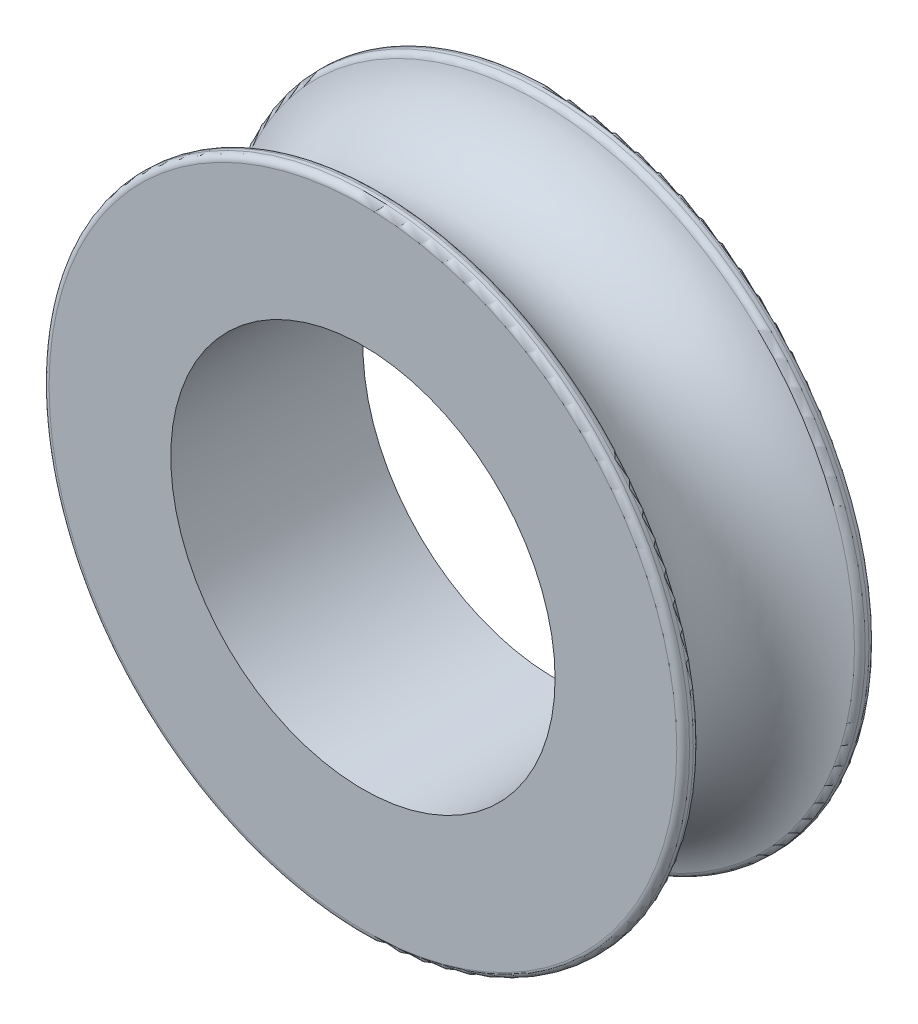
ISO-10303-21;
HEADER;
FILE_DESCRIPTION(('STEP AP214'),'2;1');
FILE_NAME('part.step','',(''),(''),'','','');
FILE_SCHEMA(('AUTOMOTIVE_DESIGN { 1 0 10303 214 1 1 1 1 }'));
ENDSEC;
DATA;
#1=APPLICATION_CONTEXT('core data for automotive mechanical design processes');
#2=APPLICATION_PROTOCOL_DEFINITION('international standard','automotive_design',2000,#1);
#3=PRODUCT_CONTEXT('',#1,'mechanical');
#4=PRODUCT('Part','Part','',(#3));
#5=PRODUCT_RELATED_PRODUCT_CATEGORY('part','',(#4));
#6=PRODUCT_DEFINITION_FORMATION('','',#4);
#7=PRODUCT_DEFINITION_CONTEXT('part definition',#1,'design');
#8=PRODUCT_DEFINITION('design','',#6,#7);
#9=PRODUCT_DEFINITION_SHAPE('','',#8);
#10=(LENGTH_UNIT() NAMED_UNIT(*) SI_UNIT(.MILLI.,.METRE.));
#11=(NAMED_UNIT(*) PLANE_ANGLE_UNIT() SI_UNIT($,.RADIAN.));
#12=(NAMED_UNIT(*) SI_UNIT($,.STERADIAN.) SOLID_ANGLE_UNIT());
#13=UNCERTAINTY_MEASURE_WITH_UNIT(LENGTH_MEASURE(1.E-05),#10,'distance_accuracy_value','');
#14=(GEOMETRIC_REPRESENTATION_CONTEXT(3) GLOBAL_UNCERTAINTY_ASSIGNED_CONTEXT((#13)) GLOBAL_UNIT_ASSIGNED_CONTEXT((#10,
#11,#12)) REPRESENTATION_CONTEXT('',''));
#15=CARTESIAN_POINT('',(0.,0.,0.));
#16=DIRECTION('',(0.,0.,1.));
#17=DIRECTION('',(1.,0.,0.));
#18=AXIS2_PLACEMENT_3D('',#15,#16,#17);
#19=CARTESIAN_POINT('',(0.,0.,0.));
#20=DIRECTION('',(0.,0.,1.));
#21=DIRECTION('',(1.,0.,0.));
#22=AXIS2_PLACEMENT_3D('',#19,#20,#21);
#23=CYLINDRICAL_SURFACE('',#22,3.);
#24=CARTESIAN_POINT('',(0.,0.,-1.5));
#25=DIRECTION('',(0.,0.,1.));
#26=DIRECTION('',(1.,0.,0.));
#27=AXIS2_PLACEMENT_3D('',#24,#25,#26);
#28=CIRCLE('',#27,3.);
#29=CARTESIAN_POINT('',(3.,0.,-1.5));
#30=VERTEX_POINT('',#29);
#31=EDGE_CURVE('E66',#30,#30,#28,.T.);
#32=ORIENTED_EDGE('',*,*,#31,.F.);
#33=EDGE_LOOP('',(#32));
#34=FACE_BOUND('',#33,.T.);
#35=CARTESIAN_POINT('',(0.,0.,1.5));
#36=DIRECTION('',(0.,0.,1.));
#37=DIRECTION('',(1.,0.,0.));
#38=AXIS2_PLACEMENT_3D('',#35,#36,#37);
#39=CIRCLE('',#38,3.);
#40=CARTESIAN_POINT('',(3.,0.,1.5));
#41=VERTEX_POINT('',#40);
#42=EDGE_CURVE('E63',#41,#41,#39,.T.);
#43=ORIENTED_EDGE('',*,*,#42,.T.);
#44=EDGE_LOOP('',(#43));
#45=FACE_BOUND('',#44,.T.);
#46=ADVANCED_FACE('F31',(#34,#45),#23,.F.);
#47=CARTESIAN_POINT('',(0.,3.,1.5));
#48=DIRECTION('',(0.,0.,1.));
#49=DIRECTION('',(1.,0.,0.));
#50=AXIS2_PLACEMENT_3D('',#47,#48,#49);
#51=PLANE('',#50);
#52=CARTESIAN_POINT('',(0.,0.,1.5));
#53=DIRECTION('',(0.,0.,1.));
#54=DIRECTION('',(1.,0.,0.));
#55=AXIS2_PLACEMENT_3D('',#52,#53,#54);
#56=CIRCLE('',#55,4.9);
#57=CARTESIAN_POINT('',(4.9,0.,1.5));
#58=VERTEX_POINT('',#57);
#59=EDGE_CURVE('E60',#58,#58,#56,.T.);
#60=ORIENTED_EDGE('',*,*,#59,.T.);
#61=EDGE_LOOP('',(#60));
#62=FACE_BOUND('',#61,.T.);
#63=ORIENTED_EDGE('',*,*,#42,.F.);
#64=EDGE_LOOP('',(#63));
#65=FACE_BOUND('',#64,.T.);
#66=ADVANCED_FACE('F74',(#62,#65),#51,.T.);
#67=CARTESIAN_POINT('',(0.,0.,0.));
#68=DIRECTION('',(0.,0.,1.));
#69=DIRECTION('',(1.,0.,0.));
#70=AXIS2_PLACEMENT_3D('',#67,#68,#69);
#71=CYLINDRICAL_SURFACE('',#70,5.);
#72=CARTESIAN_POINT('',(0.,0.,1.4));
#73=DIRECTION('',(0.,0.,1.));
#74=DIRECTION('',(1.,0.,0.));
#75=AXIS2_PLACEMENT_3D('',#72,#73,#74);
#76=CIRCLE('',#75,5.);
#77=CARTESIAN_POINT('',(5.,0.,1.4));
#78=VERTEX_POINT('',#77);
#79=EDGE_CURVE('E54',#78,#78,#76,.F.);
#80=ORIENTED_EDGE('',*,*,#79,.T.);
#81=EDGE_LOOP('',(#80));
#82=FACE_BOUND('',#81,.T.);
#83=CARTESIAN_POINT('',(0.,0.,1.34164078649987));
#84=DIRECTION('',(0.,0.,-1.));
#85=DIRECTION('',(-1.,0.,0.));
#86=AXIS2_PLACEMENT_3D('',#83,#84,#85);
#87=CIRCLE('',#86,5.);
#88=CARTESIAN_POINT('',(-5.,0.,1.34164078649987));
#89=VERTEX_POINT('',#88);
#90=EDGE_CURVE('E57',#89,#89,#87,.F.);
#91=ORIENTED_EDGE('',*,*,#90,.T.);
#92=EDGE_LOOP('',(#91));
#93=FACE_BOUND('',#92,.T.);
#94=ADVANCED_FACE('F79',(#82,#93),#71,.T.);
#95=CARTESIAN_POINT('',(0.,0.,0.));
#96=DIRECTION('',(0.,0.,1.));
#97=DIRECTION('',(1.,0.,0.));
#98=AXIS2_PLACEMENT_3D('',#95,#96,#97);
#99=TOROIDAL_SURFACE('',#98,5.3,1.3);
#100=CARTESIAN_POINT('',(0.,0.,1.24580930174994));
#101=DIRECTION('',(0.,0.,-1.));
#102=DIRECTION('',(-1.,0.,0.));
#103=AXIS2_PLACEMENT_3D('',#100,#101,#102);
#104=CIRCLE('',#103,4.92857142857141);
#105=CARTESIAN_POINT('',(-4.92857142857141,0.,1.24580930174994));
#106=VERTEX_POINT('',#105);
#107=EDGE_CURVE('E46',#106,#106,#104,.T.);
#108=ORIENTED_EDGE('',*,*,#107,.T.);
#109=EDGE_LOOP('',(#108));
#110=FACE_BOUND('',#109,.T.);
#111=CARTESIAN_POINT('',(0.,0.,-1.24580930174988));
#112=DIRECTION('',(0.,0.,1.));
#113=DIRECTION('',(1.,0.,0.));
#114=AXIS2_PLACEMENT_3D('',#111,#112,#113);
#115=CIRCLE('',#114,4.92857142857143);
#116=CARTESIAN_POINT('',(4.92857142857143,0.,-1.24580930174988));
#117=VERTEX_POINT('',#116);
#118=EDGE_CURVE('E51',#117,#117,#115,.T.);
#119=ORIENTED_EDGE('',*,*,#118,.T.);
#120=EDGE_LOOP('',(#119));
#121=FACE_BOUND('',#120,.T.);
#122=ADVANCED_FACE('F85',(#110,#121),#99,.F.);
#123=CARTESIAN_POINT('',(0.,0.,0.));
#124=DIRECTION('',(0.,0.,1.));
#125=DIRECTION('',(1.,0.,0.));
#126=AXIS2_PLACEMENT_3D('',#123,#124,#125);
#127=CYLINDRICAL_SURFACE('',#126,5.);
#128=CARTESIAN_POINT('',(0.,0.,-1.34164078649987));
#129=DIRECTION('',(0.,0.,-1.));
#130=DIRECTION('',(-1.,0.,0.));
#131=AXIS2_PLACEMENT_3D('',#128,#129,#130);
#132=CIRCLE('',#131,5.);
#133=CARTESIAN_POINT('',(-5.,0.,-1.34164078649987));
#134=VERTEX_POINT('',#133);
#135=EDGE_CURVE('E38',#134,#134,#132,.T.);
#136=ORIENTED_EDGE('',*,*,#135,.T.);
#137=EDGE_LOOP('',(#136));
#138=FACE_BOUND('',#137,.T.);
#139=CARTESIAN_POINT('',(0.,0.,-1.4));
#140=DIRECTION('',(0.,0.,1.));
#141=DIRECTION('',(1.,0.,0.));
#142=AXIS2_PLACEMENT_3D('',#139,#140,#141);
#143=CIRCLE('',#142,5.);
#144=CARTESIAN_POINT('',(5.,0.,-1.4));
#145=VERTEX_POINT('',#144);
#146=EDGE_CURVE('E42',#145,#145,#143,.T.);
#147=ORIENTED_EDGE('',*,*,#146,.T.);
#148=EDGE_LOOP('',(#147));
#149=FACE_BOUND('',#148,.T.);
#150=ADVANCED_FACE('F108',(#138,#149),#127,.T.);
#151=CARTESIAN_POINT('',(0.,3.,-1.5));
#152=DIRECTION('',(0.,0.,1.));
#153=DIRECTION('',(1.,0.,0.));
#154=AXIS2_PLACEMENT_3D('',#151,#152,#153);
#155=PLANE('',#154);
#156=CARTESIAN_POINT('',(0.,0.,-1.5));
#157=DIRECTION('',(0.,0.,1.));
#158=DIRECTION('',(1.,0.,0.));
#159=AXIS2_PLACEMENT_3D('',#156,#157,#158);
#160=CIRCLE('',#159,4.9);
#161=CARTESIAN_POINT('',(4.9,0.,-1.5));
#162=VERTEX_POINT('',#161);
#163=EDGE_CURVE('E10',#162,#162,#160,.F.);
#164=ORIENTED_EDGE('',*,*,#163,.T.);
#165=EDGE_LOOP('',(#164));
#166=FACE_BOUND('',#165,.T.);
#167=ORIENTED_EDGE('',*,*,#31,.T.);
#168=EDGE_LOOP('',(#167));
#169=FACE_BOUND('',#168,.T.);
#170=ADVANCED_FACE('F70',(#166,#169),#155,.F.);
#171=CARTESIAN_POINT('',(0.,0.,1.4));
#172=DIRECTION('',(0.,0.,1.));
#173=DIRECTION('',(1.,0.,0.));
#174=AXIS2_PLACEMENT_3D('',#171,#172,#173);
#175=TOROIDAL_SURFACE('',#174,4.9,0.1);
#176=ORIENTED_EDGE('',*,*,#79,.F.);
#177=EDGE_LOOP('',(#176));
#178=FACE_BOUND('',#177,.T.);
#179=ORIENTED_EDGE('',*,*,#59,.F.);
#180=EDGE_LOOP('',(#179));
#181=FACE_BOUND('',#180,.T.);
#182=ADVANCED_FACE('F90',(#178,#181),#175,.T.);
#183=CARTESIAN_POINT('',(0.,0.,1.34164078649987));
#184=DIRECTION('',(0.,0.,-1.));
#185=DIRECTION('',(-1.,0.,0.));
#186=AXIS2_PLACEMENT_3D('',#183,#184,#185);
#187=TOROIDAL_SURFACE('',#186,4.9,0.1);
#188=ORIENTED_EDGE('',*,*,#107,.F.);
#189=EDGE_LOOP('',(#188));
#190=FACE_BOUND('',#189,.T.);
#191=ORIENTED_EDGE('',*,*,#90,.F.);
#192=EDGE_LOOP('',(#191));
#193=FACE_BOUND('',#192,.T.);
#194=ADVANCED_FACE('F93',(#190,#193),#187,.T.);
#195=CARTESIAN_POINT('',(0.,0.,-1.34164078649987));
#196=DIRECTION('',(0.,0.,-1.));
#197=DIRECTION('',(-1.,0.,0.));
#198=AXIS2_PLACEMENT_3D('',#195,#196,#197);
#199=TOROIDAL_SURFACE('',#198,4.9,0.1);
#200=ORIENTED_EDGE('',*,*,#135,.F.);
#201=EDGE_LOOP('',(#200));
#202=FACE_BOUND('',#201,.T.);
#203=ORIENTED_EDGE('',*,*,#118,.F.);
#204=EDGE_LOOP('',(#203));
#205=FACE_BOUND('',#204,.T.);
#206=ADVANCED_FACE('F96',(#202,#205),#199,.T.);
#207=CARTESIAN_POINT('',(0.,0.,-1.4));
#208=DIRECTION('',(0.,0.,1.));
#209=DIRECTION('',(1.,0.,0.));
#210=AXIS2_PLACEMENT_3D('',#207,#208,#209);
#211=TOROIDAL_SURFACE('',#210,4.9,0.1);
#212=ORIENTED_EDGE('',*,*,#163,.F.);
#213=EDGE_LOOP('',(#212));
#214=FACE_BOUND('',#213,.T.);
#215=ORIENTED_EDGE('',*,*,#146,.F.);
#216=EDGE_LOOP('',(#215));
#217=FACE_BOUND('',#216,.T.);
#218=ADVANCED_FACE('F33',(#214,#217),#211,.T.);
#219=CLOSED_SHELL('',(#46,#66,#94,#122,#150,#170,#182,#194,#206,#218));
#220=MANIFOLD_SOLID_BREP('B2',#219);
#221=ADVANCED_BREP_SHAPE_REPRESENTATION('',(#18,#220),#14);
#222=SHAPE_DEFINITION_REPRESENTATION(#9,#221);
ENDSEC;
END-ISO-10303-21;
